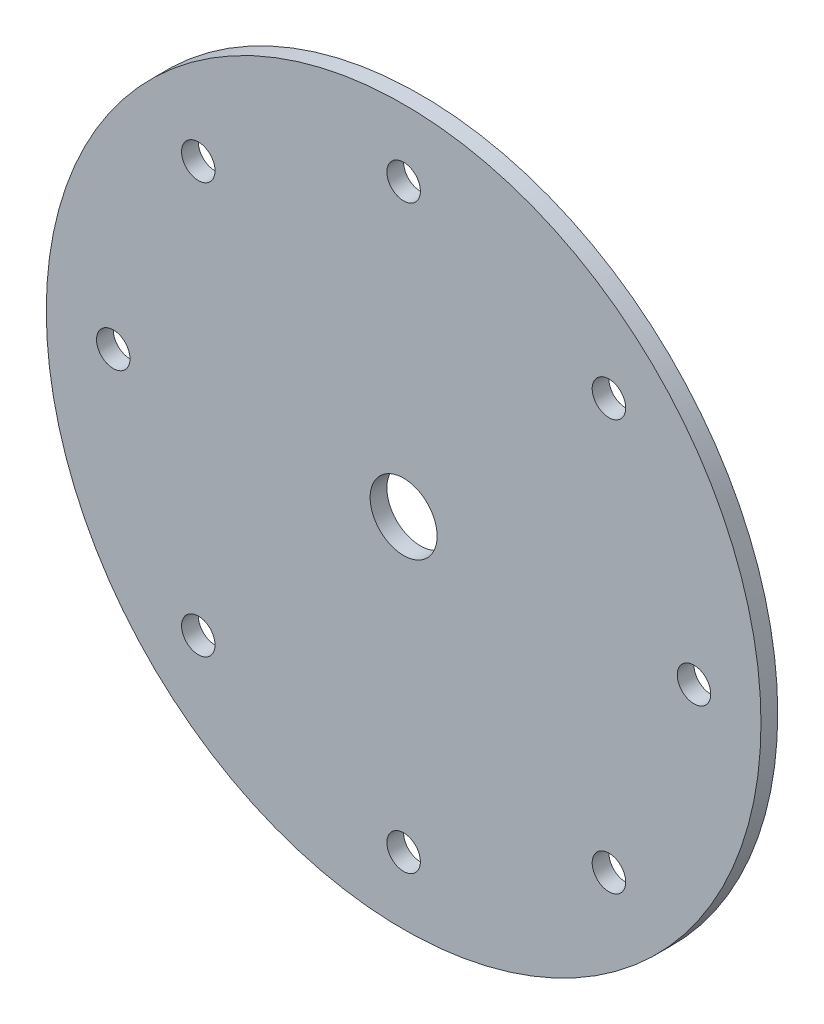
ISO-10303-21;
HEADER;
FILE_DESCRIPTION(('STEP AP214'),'2;1');
FILE_NAME('part.step','',(''),(''),'','','');
FILE_SCHEMA(('AUTOMOTIVE_DESIGN { 1 0 10303 214 1 1 1 1 }'));
ENDSEC;
DATA;
#1=APPLICATION_CONTEXT('core data for automotive mechanical design processes');
#2=APPLICATION_PROTOCOL_DEFINITION('international standard','automotive_design',2000,#1);
#3=PRODUCT_CONTEXT('',#1,'mechanical');
#4=PRODUCT('Part','Part','',(#3));
#5=PRODUCT_RELATED_PRODUCT_CATEGORY('part','',(#4));
#6=PRODUCT_DEFINITION_FORMATION('','',#4);
#7=PRODUCT_DEFINITION_CONTEXT('part definition',#1,'design');
#8=PRODUCT_DEFINITION('design','',#6,#7);
#9=PRODUCT_DEFINITION_SHAPE('','',#8);
#10=(LENGTH_UNIT() NAMED_UNIT(*) SI_UNIT(.MILLI.,.METRE.));
#11=(NAMED_UNIT(*) PLANE_ANGLE_UNIT() SI_UNIT($,.RADIAN.));
#12=(NAMED_UNIT(*) SI_UNIT($,.STERADIAN.) SOLID_ANGLE_UNIT());
#13=UNCERTAINTY_MEASURE_WITH_UNIT(LENGTH_MEASURE(1.E-05),#10,'distance_accuracy_value','');
#14=(GEOMETRIC_REPRESENTATION_CONTEXT(3) GLOBAL_UNCERTAINTY_ASSIGNED_CONTEXT((#13)) GLOBAL_UNIT_ASSIGNED_CONTEXT((#10,
#11,#12)) REPRESENTATION_CONTEXT('',''));
#15=CARTESIAN_POINT('',(0.,0.,0.));
#16=DIRECTION('',(0.,0.,1.));
#17=DIRECTION('',(1.,0.,0.));
#18=AXIS2_PLACEMENT_3D('',#15,#16,#17);
#19=CARTESIAN_POINT('',(0.,0.,4.7625));
#20=DIRECTION('',(0.,0.,-1.));
#21=DIRECTION('',(-1.,0.,0.));
#22=AXIS2_PLACEMENT_3D('',#19,#20,#21);
#23=CYLINDRICAL_SURFACE('',#22,9.525);
#24=CARTESIAN_POINT('',(0.,0.,4.7625));
#25=DIRECTION('',(0.,0.,1.));
#26=DIRECTION('',(1.,0.,0.));
#27=AXIS2_PLACEMENT_3D('',#24,#25,#26);
#28=CIRCLE('',#27,9.525);
#29=CARTESIAN_POINT('',(9.525,0.,4.7625));
#30=VERTEX_POINT('',#29);
#31=EDGE_CURVE('E48',#30,#30,#28,.T.);
#32=ORIENTED_EDGE('',*,*,#31,.T.);
#33=EDGE_LOOP('',(#32));
#34=FACE_BOUND('',#33,.T.);
#35=CARTESIAN_POINT('',(0.,0.,0.));
#36=DIRECTION('',(0.,0.,1.));
#37=DIRECTION('',(1.,0.,0.));
#38=AXIS2_PLACEMENT_3D('',#35,#36,#37);
#39=CIRCLE('',#38,9.525);
#40=CARTESIAN_POINT('',(9.525,0.,0.));
#41=VERTEX_POINT('',#40);
#42=EDGE_CURVE('E89',#41,#41,#39,.T.);
#43=ORIENTED_EDGE('',*,*,#42,.F.);
#44=EDGE_LOOP('',(#43));
#45=FACE_BOUND('',#44,.T.);
#46=ADVANCED_FACE('F39',(#34,#45),#23,.F.);
#47=CARTESIAN_POINT('',(0.,82.55,4.7625));
#48=DIRECTION('',(0.,0.,-1.));
#49=DIRECTION('',(-1.,0.,0.));
#50=AXIS2_PLACEMENT_3D('',#47,#48,#49);
#51=CYLINDRICAL_SURFACE('',#50,4.7625);
#52=CARTESIAN_POINT('',(0.,82.55,4.7625));
#53=DIRECTION('',(0.,0.,1.));
#54=DIRECTION('',(1.,0.,0.));
#55=AXIS2_PLACEMENT_3D('',#52,#53,#54);
#56=CIRCLE('',#55,4.7625);
#57=CARTESIAN_POINT('',(4.7625,82.55,4.7625));
#58=VERTEX_POINT('',#57);
#59=EDGE_CURVE('E54',#58,#58,#56,.T.);
#60=ORIENTED_EDGE('',*,*,#59,.T.);
#61=EDGE_LOOP('',(#60));
#62=FACE_BOUND('',#61,.T.);
#63=CARTESIAN_POINT('',(0.,82.55,0.));
#64=DIRECTION('',(0.,0.,1.));
#65=DIRECTION('',(1.,0.,0.));
#66=AXIS2_PLACEMENT_3D('',#63,#64,#65);
#67=CIRCLE('',#66,4.7625);
#68=CARTESIAN_POINT('',(4.7625,82.55,0.));
#69=VERTEX_POINT('',#68);
#70=EDGE_CURVE('E86',#69,#69,#67,.T.);
#71=ORIENTED_EDGE('',*,*,#70,.F.);
#72=EDGE_LOOP('',(#71));
#73=FACE_BOUND('',#72,.T.);
#74=ADVANCED_FACE('F132',(#62,#73),#51,.F.);
#75=CARTESIAN_POINT('',(58.3716647869495,58.3716647869495,4.7625));
#76=DIRECTION('',(0.,0.,-1.));
#77=DIRECTION('',(-1.,0.,0.));
#78=AXIS2_PLACEMENT_3D('',#75,#76,#77);
#79=CYLINDRICAL_SURFACE('',#78,4.76249999999999);
#80=CARTESIAN_POINT('',(58.3716647869495,58.3716647869495,4.7625));
#81=DIRECTION('',(0.,0.,1.));
#82=DIRECTION('',(1.,0.,0.));
#83=AXIS2_PLACEMENT_3D('',#80,#81,#82);
#84=CIRCLE('',#83,4.76249999999999);
#85=CARTESIAN_POINT('',(63.1341647869495,58.3716647869495,4.7625));
#86=VERTEX_POINT('',#85);
#87=EDGE_CURVE('E125',#86,#86,#84,.T.);
#88=ORIENTED_EDGE('',*,*,#87,.T.);
#89=EDGE_LOOP('',(#88));
#90=FACE_BOUND('',#89,.T.);
#91=CARTESIAN_POINT('',(58.3716647869495,58.3716647869495,0.));
#92=DIRECTION('',(0.,0.,1.));
#93=DIRECTION('',(1.,0.,0.));
#94=AXIS2_PLACEMENT_3D('',#91,#92,#93);
#95=CIRCLE('',#94,4.76249999999999);
#96=CARTESIAN_POINT('',(63.1341647869495,58.3716647869495,0.));
#97=VERTEX_POINT('',#96);
#98=EDGE_CURVE('E82',#97,#97,#95,.T.);
#99=ORIENTED_EDGE('',*,*,#98,.F.);
#100=EDGE_LOOP('',(#99));
#101=FACE_BOUND('',#100,.T.);
#102=ADVANCED_FACE('F150',(#90,#101),#79,.F.);
#103=CARTESIAN_POINT('',(82.55,0.,4.7625));
#104=DIRECTION('',(0.,0.,-1.));
#105=DIRECTION('',(-1.,0.,0.));
#106=AXIS2_PLACEMENT_3D('',#103,#104,#105);
#107=CYLINDRICAL_SURFACE('',#106,4.7625);
#108=CARTESIAN_POINT('',(82.55,0.,4.7625));
#109=DIRECTION('',(0.,0.,1.));
#110=DIRECTION('',(1.,0.,0.));
#111=AXIS2_PLACEMENT_3D('',#108,#109,#110);
#112=CIRCLE('',#111,4.7625);
#113=CARTESIAN_POINT('',(87.3125,0.,4.7625));
#114=VERTEX_POINT('',#113);
#115=EDGE_CURVE('E121',#114,#114,#112,.T.);
#116=ORIENTED_EDGE('',*,*,#115,.T.);
#117=EDGE_LOOP('',(#116));
#118=FACE_BOUND('',#117,.T.);
#119=CARTESIAN_POINT('',(82.55,0.,0.));
#120=DIRECTION('',(0.,0.,1.));
#121=DIRECTION('',(1.,0.,0.));
#122=AXIS2_PLACEMENT_3D('',#119,#120,#121);
#123=CIRCLE('',#122,4.7625);
#124=CARTESIAN_POINT('',(87.3125,0.,0.));
#125=VERTEX_POINT('',#124);
#126=EDGE_CURVE('E78',#125,#125,#123,.T.);
#127=ORIENTED_EDGE('',*,*,#126,.F.);
#128=EDGE_LOOP('',(#127));
#129=FACE_BOUND('',#128,.T.);
#130=ADVANCED_FACE('F157',(#118,#129),#107,.F.);
#131=CARTESIAN_POINT('',(58.3716647869495,-58.3716647869495,4.7625));
#132=DIRECTION('',(0.,0.,-1.));
#133=DIRECTION('',(-1.,0.,0.));
#134=AXIS2_PLACEMENT_3D('',#131,#132,#133);
#135=CYLINDRICAL_SURFACE('',#134,4.7625);
#136=CARTESIAN_POINT('',(58.3716647869495,-58.3716647869495,4.7625));
#137=DIRECTION('',(0.,0.,1.));
#138=DIRECTION('',(1.,0.,0.));
#139=AXIS2_PLACEMENT_3D('',#136,#137,#138);
#140=CIRCLE('',#139,4.7625);
#141=CARTESIAN_POINT('',(63.1341647869495,-58.3716647869495,4.7625));
#142=VERTEX_POINT('',#141);
#143=EDGE_CURVE('E117',#142,#142,#140,.T.);
#144=ORIENTED_EDGE('',*,*,#143,.T.);
#145=EDGE_LOOP('',(#144));
#146=FACE_BOUND('',#145,.T.);
#147=CARTESIAN_POINT('',(58.3716647869495,-58.3716647869495,0.));
#148=DIRECTION('',(0.,0.,1.));
#149=DIRECTION('',(1.,0.,0.));
#150=AXIS2_PLACEMENT_3D('',#147,#148,#149);
#151=CIRCLE('',#150,4.7625);
#152=CARTESIAN_POINT('',(63.1341647869495,-58.3716647869495,0.));
#153=VERTEX_POINT('',#152);
#154=EDGE_CURVE('E74',#153,#153,#151,.T.);
#155=ORIENTED_EDGE('',*,*,#154,.F.);
#156=EDGE_LOOP('',(#155));
#157=FACE_BOUND('',#156,.T.);
#158=ADVANCED_FACE('F161',(#146,#157),#135,.F.);
#159=CARTESIAN_POINT('',(0.,-82.55,4.7625));
#160=DIRECTION('',(0.,0.,-1.));
#161=DIRECTION('',(-1.,0.,0.));
#162=AXIS2_PLACEMENT_3D('',#159,#160,#161);
#163=CYLINDRICAL_SURFACE('',#162,4.7625);
#164=CARTESIAN_POINT('',(0.,-82.55,4.7625));
#165=DIRECTION('',(0.,0.,1.));
#166=DIRECTION('',(1.,0.,0.));
#167=AXIS2_PLACEMENT_3D('',#164,#165,#166);
#168=CIRCLE('',#167,4.7625);
#169=CARTESIAN_POINT('',(4.76250000000002,-82.55,4.7625));
#170=VERTEX_POINT('',#169);
#171=EDGE_CURVE('E113',#170,#170,#168,.T.);
#172=ORIENTED_EDGE('',*,*,#171,.T.);
#173=EDGE_LOOP('',(#172));
#174=FACE_BOUND('',#173,.T.);
#175=CARTESIAN_POINT('',(0.,-82.55,0.));
#176=DIRECTION('',(0.,0.,1.));
#177=DIRECTION('',(1.,0.,0.));
#178=AXIS2_PLACEMENT_3D('',#175,#176,#177);
#179=CIRCLE('',#178,4.7625);
#180=CARTESIAN_POINT('',(4.76250000000002,-82.55,0.));
#181=VERTEX_POINT('',#180);
#182=EDGE_CURVE('E70',#181,#181,#179,.T.);
#183=ORIENTED_EDGE('',*,*,#182,.F.);
#184=EDGE_LOOP('',(#183));
#185=FACE_BOUND('',#184,.T.);
#186=ADVANCED_FACE('F165',(#174,#185),#163,.F.);
#187=CARTESIAN_POINT('',(-58.3716647869495,-58.3716647869495,4.7625));
#188=DIRECTION('',(0.,0.,-1.));
#189=DIRECTION('',(-1.,0.,0.));
#190=AXIS2_PLACEMENT_3D('',#187,#188,#189);
#191=CYLINDRICAL_SURFACE('',#190,4.7625);
#192=CARTESIAN_POINT('',(-58.3716647869495,-58.3716647869495,4.7625));
#193=DIRECTION('',(0.,0.,1.));
#194=DIRECTION('',(1.,0.,0.));
#195=AXIS2_PLACEMENT_3D('',#192,#193,#194);
#196=CIRCLE('',#195,4.7625);
#197=CARTESIAN_POINT('',(-53.6091647869495,-58.3716647869495,4.7625));
#198=VERTEX_POINT('',#197);
#199=EDGE_CURVE('E107',#198,#198,#196,.T.);
#200=ORIENTED_EDGE('',*,*,#199,.T.);
#201=EDGE_LOOP('',(#200));
#202=FACE_BOUND('',#201,.T.);
#203=CARTESIAN_POINT('',(-58.3716647869495,-58.3716647869495,0.));
#204=DIRECTION('',(0.,0.,1.));
#205=DIRECTION('',(1.,0.,0.));
#206=AXIS2_PLACEMENT_3D('',#203,#204,#205);
#207=CIRCLE('',#206,4.7625);
#208=CARTESIAN_POINT('',(-53.6091647869495,-58.3716647869495,0.));
#209=VERTEX_POINT('',#208);
#210=EDGE_CURVE('E66',#209,#209,#207,.T.);
#211=ORIENTED_EDGE('',*,*,#210,.F.);
#212=EDGE_LOOP('',(#211));
#213=FACE_BOUND('',#212,.T.);
#214=ADVANCED_FACE('F169',(#202,#213),#191,.F.);
#215=CARTESIAN_POINT('',(-82.55,0.,4.7625));
#216=DIRECTION('',(0.,0.,-1.));
#217=DIRECTION('',(-1.,0.,0.));
#218=AXIS2_PLACEMENT_3D('',#215,#216,#217);
#219=CYLINDRICAL_SURFACE('',#218,4.7625);
#220=CARTESIAN_POINT('',(-82.55,0.,4.7625));
#221=DIRECTION('',(0.,0.,1.));
#222=DIRECTION('',(1.,0.,0.));
#223=AXIS2_PLACEMENT_3D('',#220,#221,#222);
#224=CIRCLE('',#223,4.7625);
#225=CARTESIAN_POINT('',(-77.7875,0.,4.7625));
#226=VERTEX_POINT('',#225);
#227=EDGE_CURVE('E101',#226,#226,#224,.T.);
#228=ORIENTED_EDGE('',*,*,#227,.T.);
#229=EDGE_LOOP('',(#228));
#230=FACE_BOUND('',#229,.T.);
#231=CARTESIAN_POINT('',(-82.55,0.,0.));
#232=DIRECTION('',(0.,0.,1.));
#233=DIRECTION('',(1.,0.,0.));
#234=AXIS2_PLACEMENT_3D('',#231,#232,#233);
#235=CIRCLE('',#234,4.7625);
#236=CARTESIAN_POINT('',(-77.7875,0.,0.));
#237=VERTEX_POINT('',#236);
#238=EDGE_CURVE('E62',#237,#237,#235,.T.);
#239=ORIENTED_EDGE('',*,*,#238,.F.);
#240=EDGE_LOOP('',(#239));
#241=FACE_BOUND('',#240,.T.);
#242=ADVANCED_FACE('F172',(#230,#241),#219,.F.);
#243=CARTESIAN_POINT('',(-58.3716647869495,58.3716647869495,4.7625));
#244=DIRECTION('',(0.,0.,-1.));
#245=DIRECTION('',(-1.,0.,0.));
#246=AXIS2_PLACEMENT_3D('',#243,#244,#245);
#247=CYLINDRICAL_SURFACE('',#246,4.7625);
#248=CARTESIAN_POINT('',(-58.3716647869495,58.3716647869495,4.7625));
#249=DIRECTION('',(0.,0.,1.));
#250=DIRECTION('',(1.,0.,0.));
#251=AXIS2_PLACEMENT_3D('',#248,#249,#250);
#252=CIRCLE('',#251,4.7625);
#253=CARTESIAN_POINT('',(-53.6091647869495,58.3716647869495,4.7625));
#254=VERTEX_POINT('',#253);
#255=EDGE_CURVE('E96',#254,#254,#252,.T.);
#256=ORIENTED_EDGE('',*,*,#255,.T.);
#257=EDGE_LOOP('',(#256));
#258=FACE_BOUND('',#257,.T.);
#259=CARTESIAN_POINT('',(-58.3716647869495,58.3716647869495,0.));
#260=DIRECTION('',(0.,0.,1.));
#261=DIRECTION('',(1.,0.,0.));
#262=AXIS2_PLACEMENT_3D('',#259,#260,#261);
#263=CIRCLE('',#262,4.7625);
#264=CARTESIAN_POINT('',(-53.6091647869495,58.3716647869495,0.));
#265=VERTEX_POINT('',#264);
#266=EDGE_CURVE('E58',#265,#265,#263,.T.);
#267=ORIENTED_EDGE('',*,*,#266,.F.);
#268=EDGE_LOOP('',(#267));
#269=FACE_BOUND('',#268,.T.);
#270=ADVANCED_FACE('F41',(#258,#269),#247,.F.);
#271=CARTESIAN_POINT('',(0.,0.,4.7625));
#272=DIRECTION('',(0.,0.,-1.));
#273=DIRECTION('',(-1.,0.,0.));
#274=AXIS2_PLACEMENT_3D('',#271,#272,#273);
#275=CYLINDRICAL_SURFACE('',#274,101.6);
#276=CARTESIAN_POINT('',(0.,0.,4.7625));
#277=DIRECTION('',(0.,0.,1.));
#278=DIRECTION('',(1.,0.,0.));
#279=AXIS2_PLACEMENT_3D('',#276,#277,#278);
#280=CIRCLE('',#279,101.6);
#281=CARTESIAN_POINT('',(101.6,0.,4.7625));
#282=VERTEX_POINT('',#281);
#283=EDGE_CURVE('E10',#282,#282,#280,.T.);
#284=ORIENTED_EDGE('',*,*,#283,.F.);
#285=EDGE_LOOP('',(#284));
#286=FACE_BOUND('',#285,.T.);
#287=CARTESIAN_POINT('',(0.,0.,0.));
#288=DIRECTION('',(0.,0.,1.));
#289=DIRECTION('',(1.,0.,0.));
#290=AXIS2_PLACEMENT_3D('',#287,#288,#289);
#291=CIRCLE('',#290,101.6);
#292=CARTESIAN_POINT('',(101.6,0.,0.));
#293=VERTEX_POINT('',#292);
#294=EDGE_CURVE('E43',#293,#293,#291,.T.);
#295=ORIENTED_EDGE('',*,*,#294,.T.);
#296=EDGE_LOOP('',(#295));
#297=FACE_BOUND('',#296,.T.);
#298=ADVANCED_FACE('F139',(#286,#297),#275,.T.);
#299=CARTESIAN_POINT('',(0.,0.,4.7625));
#300=DIRECTION('',(0.,0.,1.));
#301=DIRECTION('',(1.,0.,0.));
#302=AXIS2_PLACEMENT_3D('',#299,#300,#301);
#303=PLANE('',#302);
#304=ORIENTED_EDGE('',*,*,#255,.F.);
#305=EDGE_LOOP('',(#304));
#306=FACE_BOUND('',#305,.T.);
#307=ORIENTED_EDGE('',*,*,#227,.F.);
#308=EDGE_LOOP('',(#307));
#309=FACE_BOUND('',#308,.T.);
#310=ORIENTED_EDGE('',*,*,#199,.F.);
#311=EDGE_LOOP('',(#310));
#312=FACE_BOUND('',#311,.T.);
#313=ORIENTED_EDGE('',*,*,#171,.F.);
#314=EDGE_LOOP('',(#313));
#315=FACE_BOUND('',#314,.T.);
#316=ORIENTED_EDGE('',*,*,#143,.F.);
#317=EDGE_LOOP('',(#316));
#318=FACE_BOUND('',#317,.T.);
#319=ORIENTED_EDGE('',*,*,#115,.F.);
#320=EDGE_LOOP('',(#319));
#321=FACE_BOUND('',#320,.T.);
#322=ORIENTED_EDGE('',*,*,#87,.F.);
#323=EDGE_LOOP('',(#322));
#324=FACE_BOUND('',#323,.T.);
#325=ORIENTED_EDGE('',*,*,#59,.F.);
#326=EDGE_LOOP('',(#325));
#327=FACE_BOUND('',#326,.T.);
#328=ORIENTED_EDGE('',*,*,#31,.F.);
#329=EDGE_LOOP('',(#328));
#330=FACE_BOUND('',#329,.T.);
#331=ORIENTED_EDGE('',*,*,#283,.T.);
#332=EDGE_LOOP('',(#331));
#333=FACE_BOUND('',#332,.T.);
#334=ADVANCED_FACE('F135',(#306,#309,#312,#315,#318,#321,#324,#327,#330,#333),#303,.T.);
#335=CARTESIAN_POINT('',(0.,0.,0.));
#336=DIRECTION('',(0.,0.,1.));
#337=DIRECTION('',(1.,0.,0.));
#338=AXIS2_PLACEMENT_3D('',#335,#336,#337);
#339=PLANE('',#338);
#340=ORIENTED_EDGE('',*,*,#266,.T.);
#341=EDGE_LOOP('',(#340));
#342=FACE_BOUND('',#341,.T.);
#343=ORIENTED_EDGE('',*,*,#238,.T.);
#344=EDGE_LOOP('',(#343));
#345=FACE_BOUND('',#344,.T.);
#346=ORIENTED_EDGE('',*,*,#210,.T.);
#347=EDGE_LOOP('',(#346));
#348=FACE_BOUND('',#347,.T.);
#349=ORIENTED_EDGE('',*,*,#182,.T.);
#350=EDGE_LOOP('',(#349));
#351=FACE_BOUND('',#350,.T.);
#352=ORIENTED_EDGE('',*,*,#154,.T.);
#353=EDGE_LOOP('',(#352));
#354=FACE_BOUND('',#353,.T.);
#355=ORIENTED_EDGE('',*,*,#126,.T.);
#356=EDGE_LOOP('',(#355));
#357=FACE_BOUND('',#356,.T.);
#358=ORIENTED_EDGE('',*,*,#98,.T.);
#359=EDGE_LOOP('',(#358));
#360=FACE_BOUND('',#359,.T.);
#361=ORIENTED_EDGE('',*,*,#70,.T.);
#362=EDGE_LOOP('',(#361));
#363=FACE_BOUND('',#362,.T.);
#364=ORIENTED_EDGE('',*,*,#42,.T.);
#365=EDGE_LOOP('',(#364));
#366=FACE_BOUND('',#365,.T.);
#367=ORIENTED_EDGE('',*,*,#294,.F.);
#368=EDGE_LOOP('',(#367));
#369=FACE_BOUND('',#368,.T.);
#370=ADVANCED_FACE('F138',(#342,#345,#348,#351,#354,#357,#360,#363,#366,#369),#339,.F.);
#371=CLOSED_SHELL('',(#46,#74,#102,#130,#158,#186,#214,#242,#270,#298,#334,#370));
#372=MANIFOLD_SOLID_BREP('B2',#371);
#373=ADVANCED_BREP_SHAPE_REPRESENTATION('',(#18,#372),#14);
#374=SHAPE_DEFINITION_REPRESENTATION(#9,#373);
ENDSEC;
END-ISO-10303-21;
